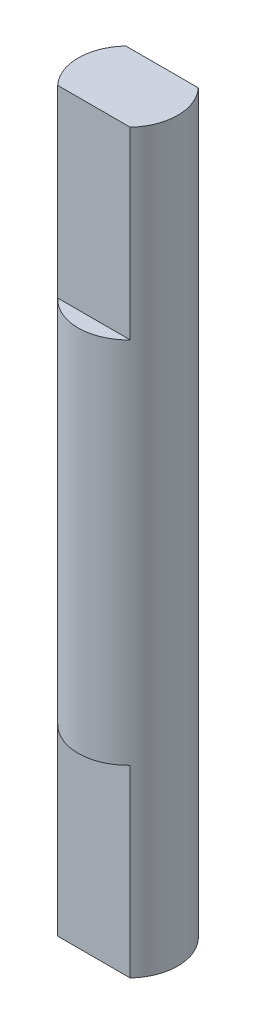
ISO-10303-21;
HEADER;
FILE_DESCRIPTION(('STEP AP214'),'2;1');
FILE_NAME('part.step','',(''),(''),'','','');
FILE_SCHEMA(('AUTOMOTIVE_DESIGN { 1 0 10303 214 1 1 1 1 }'));
ENDSEC;
DATA;
#1=APPLICATION_CONTEXT('core data for automotive mechanical design processes');
#2=APPLICATION_PROTOCOL_DEFINITION('international standard','automotive_design',2000,#1);
#3=PRODUCT_CONTEXT('',#1,'mechanical');
#4=PRODUCT('Part','Part','',(#3));
#5=PRODUCT_RELATED_PRODUCT_CATEGORY('part','',(#4));
#6=PRODUCT_DEFINITION_FORMATION('','',#4);
#7=PRODUCT_DEFINITION_CONTEXT('part definition',#1,'design');
#8=PRODUCT_DEFINITION('design','',#6,#7);
#9=PRODUCT_DEFINITION_SHAPE('','',#8);
#10=(LENGTH_UNIT() NAMED_UNIT(*) SI_UNIT(.MILLI.,.METRE.));
#11=(NAMED_UNIT(*) PLANE_ANGLE_UNIT() SI_UNIT($,.RADIAN.));
#12=(NAMED_UNIT(*) SI_UNIT($,.STERADIAN.) SOLID_ANGLE_UNIT());
#13=UNCERTAINTY_MEASURE_WITH_UNIT(LENGTH_MEASURE(1.E-05),#10,'distance_accuracy_value','');
#14=(GEOMETRIC_REPRESENTATION_CONTEXT(3) GLOBAL_UNCERTAINTY_ASSIGNED_CONTEXT((#13)) GLOBAL_UNIT_ASSIGNED_CONTEXT((#10,
#11,#12)) REPRESENTATION_CONTEXT('',''));
#15=CARTESIAN_POINT('',(0.,0.,0.));
#16=DIRECTION('',(0.,0.,1.));
#17=DIRECTION('',(1.,0.,0.));
#18=AXIS2_PLACEMENT_3D('',#15,#16,#17);
#19=CARTESIAN_POINT('',(0.,-10.,0.));
#20=DIRECTION('',(0.,1.,0.));
#21=DIRECTION('',(0.,0.,1.));
#22=AXIS2_PLACEMENT_3D('',#19,#20,#21);
#23=PLANE('',#22);
#24=CARTESIAN_POINT('',(0.,-10.,0.));
#25=DIRECTION('',(0.,1.,0.));
#26=DIRECTION('',(0.,0.,1.));
#27=AXIS2_PLACEMENT_3D('',#24,#25,#26);
#28=CIRCLE('',#27,2.7);
#29=CARTESIAN_POINT('',(1.96659604392971,-10.,-1.85));
#30=VERTEX_POINT('',#29);
#31=CARTESIAN_POINT('',(-1.96659604392971,-10.,-1.85));
#32=VERTEX_POINT('',#31);
#33=EDGE_CURVE('E154',#30,#32,#28,.T.);
#34=ORIENTED_EDGE('',*,*,#33,.F.);
#35=DIRECTION('',(-1.,0.,0.));
#36=VECTOR('',#35,1.);
#37=CARTESIAN_POINT('',(1.96659604392971,-10.,-1.85));
#38=LINE('',#37,#36);
#39=EDGE_CURVE('E114',#30,#32,#38,.T.);
#40=ORIENTED_EDGE('',*,*,#39,.T.);
#41=EDGE_LOOP('',(#34,#40));
#42=FACE_BOUND('',#41,.T.);
#43=ADVANCED_FACE('F33',(#42),#23,.F.);
#44=CARTESIAN_POINT('',(0.,10.,0.));
#45=DIRECTION('',(0.,1.,0.));
#46=DIRECTION('',(0.,0.,1.));
#47=AXIS2_PLACEMENT_3D('',#44,#45,#46);
#48=PLANE('',#47);
#49=DIRECTION('',(1.,0.,0.));
#50=VECTOR('',#49,1.);
#51=CARTESIAN_POINT('',(1.96659604392971,10.,1.85));
#52=LINE('',#51,#50);
#53=CARTESIAN_POINT('',(-1.96659604392971,10.,1.85));
#54=VERTEX_POINT('',#53);
#55=CARTESIAN_POINT('',(1.96659604392971,10.,1.85));
#56=VERTEX_POINT('',#55);
#57=EDGE_CURVE('E56',#54,#56,#52,.T.);
#58=ORIENTED_EDGE('',*,*,#57,.F.);
#59=CARTESIAN_POINT('',(0.,10.,0.));
#60=DIRECTION('',(0.,1.,0.));
#61=DIRECTION('',(0.,0.,1.));
#62=AXIS2_PLACEMENT_3D('',#59,#60,#61);
#63=CIRCLE('',#62,2.7);
#64=EDGE_CURVE('E42',#54,#56,#63,.T.);
#65=ORIENTED_EDGE('',*,*,#64,.T.);
#66=EDGE_LOOP('',(#58,#65));
#67=FACE_BOUND('',#66,.T.);
#68=ADVANCED_FACE('F171',(#67),#48,.T.);
#69=CARTESIAN_POINT('',(0.,10.,0.));
#70=DIRECTION('',(0.,-1.,0.));
#71=DIRECTION('',(0.,0.,-1.));
#72=AXIS2_PLACEMENT_3D('',#69,#70,#71);
#73=CYLINDRICAL_SURFACE('',#72,2.7);
#74=CARTESIAN_POINT('',(1.96659604392971,10.,-1.85));
#75=VERTEX_POINT('',#74);
#76=CARTESIAN_POINT('',(-1.96659604392971,10.,-1.85));
#77=VERTEX_POINT('',#76);
#78=EDGE_CURVE('E11',#75,#77,#63,.T.);
#79=ORIENTED_EDGE('',*,*,#78,.F.);
#80=DIRECTION('',(0.,-1.,0.));
#81=VECTOR('',#80,1.);
#82=CARTESIAN_POINT('',(1.96659604392971,20.,-1.85));
#83=LINE('',#82,#81);
#84=CARTESIAN_POINT('',(1.96659604392971,20.,-1.85));
#85=VERTEX_POINT('',#84);
#86=EDGE_CURVE('E152',#85,#75,#83,.T.);
#87=ORIENTED_EDGE('',*,*,#86,.F.);
#88=CARTESIAN_POINT('',(0.,20.,0.));
#89=DIRECTION('',(0.,1.,0.));
#90=DIRECTION('',(0.,0.,1.));
#91=AXIS2_PLACEMENT_3D('',#88,#89,#90);
#92=CIRCLE('',#91,2.7);
#93=CARTESIAN_POINT('',(1.96659604392971,20.,1.85));
#94=VERTEX_POINT('',#93);
#95=EDGE_CURVE('E131',#94,#85,#92,.T.);
#96=ORIENTED_EDGE('',*,*,#95,.F.);
#97=DIRECTION('',(0.,-1.,0.));
#98=VECTOR('',#97,1.);
#99=CARTESIAN_POINT('',(1.96659604392971,20.,1.85));
#100=LINE('',#99,#98);
#101=EDGE_CURVE('E140',#94,#56,#100,.T.);
#102=ORIENTED_EDGE('',*,*,#101,.T.);
#103=ORIENTED_EDGE('',*,*,#64,.F.);
#104=DIRECTION('',(0.,-1.,0.));
#105=VECTOR('',#104,1.);
#106=CARTESIAN_POINT('',(-1.96659604392971,20.,1.85));
#107=LINE('',#106,#105);
#108=CARTESIAN_POINT('',(-1.96659604392971,20.,1.85));
#109=VERTEX_POINT('',#108);
#110=EDGE_CURVE('E146',#109,#54,#107,.T.);
#111=ORIENTED_EDGE('',*,*,#110,.F.);
#112=CARTESIAN_POINT('',(0.,20.,0.));
#113=DIRECTION('',(0.,1.,0.));
#114=DIRECTION('',(0.,0.,1.));
#115=AXIS2_PLACEMENT_3D('',#112,#113,#114);
#116=CIRCLE('',#115,2.7);
#117=CARTESIAN_POINT('',(-1.96659604392971,20.,-1.85));
#118=VERTEX_POINT('',#117);
#119=EDGE_CURVE('E136',#118,#109,#116,.T.);
#120=ORIENTED_EDGE('',*,*,#119,.F.);
#121=DIRECTION('',(0.,-1.,0.));
#122=VECTOR('',#121,1.);
#123=CARTESIAN_POINT('',(-1.96659604392971,20.,-1.85));
#124=LINE('',#123,#122);
#125=EDGE_CURVE('E149',#118,#77,#124,.T.);
#126=ORIENTED_EDGE('',*,*,#125,.T.);
#127=EDGE_LOOP('',(#79,#87,#96,#102,#103,#111,#120,#126));
#128=FACE_BOUND('',#127,.T.);
#129=CARTESIAN_POINT('',(-1.96659604392971,-10.,1.85));
#130=VERTEX_POINT('',#129);
#131=CARTESIAN_POINT('',(1.96659604392971,-10.,1.85));
#132=VERTEX_POINT('',#131);
#133=EDGE_CURVE('E37',#130,#132,#28,.T.);
#134=ORIENTED_EDGE('',*,*,#133,.T.);
#135=DIRECTION('',(0.,1.,0.));
#136=VECTOR('',#135,1.);
#137=CARTESIAN_POINT('',(1.96659604392971,-20.,1.85));
#138=LINE('',#137,#136);
#139=CARTESIAN_POINT('',(1.96659604392971,-20.,1.85));
#140=VERTEX_POINT('',#139);
#141=EDGE_CURVE('E49',#140,#132,#138,.T.);
#142=ORIENTED_EDGE('',*,*,#141,.F.);
#143=CARTESIAN_POINT('',(0.,-20.,0.));
#144=DIRECTION('',(0.,1.,0.));
#145=DIRECTION('',(0.,0.,1.));
#146=AXIS2_PLACEMENT_3D('',#143,#144,#145);
#147=CIRCLE('',#146,2.7);
#148=CARTESIAN_POINT('',(1.96659604392971,-20.,-1.85));
#149=VERTEX_POINT('',#148);
#150=EDGE_CURVE('E100',#140,#149,#147,.T.);
#151=ORIENTED_EDGE('',*,*,#150,.T.);
#152=DIRECTION('',(0.,1.,0.));
#153=VECTOR('',#152,1.);
#154=CARTESIAN_POINT('',(1.96659604392971,-20.,-1.85));
#155=LINE('',#154,#153);
#156=EDGE_CURVE('E122',#149,#30,#155,.T.);
#157=ORIENTED_EDGE('',*,*,#156,.T.);
#158=ORIENTED_EDGE('',*,*,#33,.T.);
#159=DIRECTION('',(0.,1.,0.));
#160=VECTOR('',#159,1.);
#161=CARTESIAN_POINT('',(-1.96659604392971,-20.,-1.85));
#162=LINE('',#161,#160);
#163=CARTESIAN_POINT('',(-1.96659604392971,-20.,-1.85));
#164=VERTEX_POINT('',#163);
#165=EDGE_CURVE('E128',#164,#32,#162,.T.);
#166=ORIENTED_EDGE('',*,*,#165,.F.);
#167=CARTESIAN_POINT('',(0.,-20.,0.));
#168=DIRECTION('',(0.,1.,0.));
#169=DIRECTION('',(0.,0.,1.));
#170=AXIS2_PLACEMENT_3D('',#167,#168,#169);
#171=CIRCLE('',#170,2.7);
#172=CARTESIAN_POINT('',(-1.96659604392971,-20.,1.85));
#173=VERTEX_POINT('',#172);
#174=EDGE_CURVE('E117',#164,#173,#171,.T.);
#175=ORIENTED_EDGE('',*,*,#174,.T.);
#176=DIRECTION('',(0.,1.,0.));
#177=VECTOR('',#176,1.);
#178=CARTESIAN_POINT('',(-1.96659604392971,-20.,1.85));
#179=LINE('',#178,#177);
#180=EDGE_CURVE('E104',#173,#130,#179,.T.);
#181=ORIENTED_EDGE('',*,*,#180,.T.);
#182=EDGE_LOOP('',(#134,#142,#151,#157,#158,#166,#175,#181));
#183=FACE_BOUND('',#182,.T.);
#184=ADVANCED_FACE('F35',(#128,#183),#73,.T.);
#185=DIRECTION('',(-1.,0.,0.));
#186=VECTOR('',#185,1.);
#187=CARTESIAN_POINT('',(1.96659604392971,10.,-1.85));
#188=LINE('',#187,#186);
#189=EDGE_CURVE('E103',#75,#77,#188,.T.);
#190=ORIENTED_EDGE('',*,*,#189,.F.);
#191=ORIENTED_EDGE('',*,*,#78,.T.);
#192=EDGE_LOOP('',(#190,#191));
#193=FACE_BOUND('',#192,.T.);
#194=ADVANCED_FACE('F177',(#193),#48,.T.);
#195=ORIENTED_EDGE('',*,*,#133,.F.);
#196=DIRECTION('',(1.,0.,0.));
#197=VECTOR('',#196,1.);
#198=CARTESIAN_POINT('',(1.96659604392971,-10.,1.85));
#199=LINE('',#198,#197);
#200=EDGE_CURVE('E123',#130,#132,#199,.T.);
#201=ORIENTED_EDGE('',*,*,#200,.T.);
#202=EDGE_LOOP('',(#195,#201));
#203=FACE_BOUND('',#202,.T.);
#204=ADVANCED_FACE('F172',(#203),#23,.F.);
#205=CARTESIAN_POINT('',(1.96659604392971,20.,-1.85));
#206=DIRECTION('',(0.,0.,1.));
#207=DIRECTION('',(1.,0.,0.));
#208=AXIS2_PLACEMENT_3D('',#205,#206,#207);
#209=PLANE('',#208);
#210=ORIENTED_EDGE('',*,*,#189,.T.);
#211=ORIENTED_EDGE('',*,*,#125,.F.);
#212=DIRECTION('',(-1.,0.,0.));
#213=VECTOR('',#212,1.);
#214=CARTESIAN_POINT('',(1.96659604392971,20.,-1.85));
#215=LINE('',#214,#213);
#216=EDGE_CURVE('E134',#85,#118,#215,.T.);
#217=ORIENTED_EDGE('',*,*,#216,.F.);
#218=ORIENTED_EDGE('',*,*,#86,.T.);
#219=EDGE_LOOP('',(#210,#211,#217,#218));
#220=FACE_BOUND('',#219,.T.);
#221=ADVANCED_FACE('F179',(#220),#209,.F.);
#222=CARTESIAN_POINT('',(1.96659604392971,20.,1.85));
#223=DIRECTION('',(0.,0.,-1.));
#224=DIRECTION('',(-1.,0.,0.));
#225=AXIS2_PLACEMENT_3D('',#222,#223,#224);
#226=PLANE('',#225);
#227=ORIENTED_EDGE('',*,*,#57,.T.);
#228=ORIENTED_EDGE('',*,*,#101,.F.);
#229=DIRECTION('',(1.,0.,0.));
#230=VECTOR('',#229,1.);
#231=CARTESIAN_POINT('',(1.96659604392971,20.,1.85));
#232=LINE('',#231,#230);
#233=EDGE_CURVE('E138',#109,#94,#232,.T.);
#234=ORIENTED_EDGE('',*,*,#233,.F.);
#235=ORIENTED_EDGE('',*,*,#110,.T.);
#236=EDGE_LOOP('',(#227,#228,#234,#235));
#237=FACE_BOUND('',#236,.T.);
#238=ADVANCED_FACE('F185',(#237),#226,.F.);
#239=CARTESIAN_POINT('',(0.,20.,0.));
#240=DIRECTION('',(0.,1.,0.));
#241=DIRECTION('',(0.,0.,1.));
#242=AXIS2_PLACEMENT_3D('',#239,#240,#241);
#243=PLANE('',#242);
#244=ORIENTED_EDGE('',*,*,#95,.T.);
#245=ORIENTED_EDGE('',*,*,#216,.T.);
#246=ORIENTED_EDGE('',*,*,#119,.T.);
#247=ORIENTED_EDGE('',*,*,#233,.T.);
#248=EDGE_LOOP('',(#244,#245,#246,#247));
#249=FACE_BOUND('',#248,.T.);
#250=ADVANCED_FACE('F168',(#249),#243,.T.);
#251=CARTESIAN_POINT('',(1.96659604392971,-20.,1.85));
#252=DIRECTION('',(0.,0.,1.));
#253=DIRECTION('',(1.,0.,0.));
#254=AXIS2_PLACEMENT_3D('',#251,#252,#253);
#255=PLANE('',#254);
#256=ORIENTED_EDGE('',*,*,#200,.F.);
#257=ORIENTED_EDGE('',*,*,#180,.F.);
#258=DIRECTION('',(1.,0.,0.));
#259=VECTOR('',#258,1.);
#260=CARTESIAN_POINT('',(1.96659604392971,-20.,1.85));
#261=LINE('',#260,#259);
#262=EDGE_CURVE('E110',#173,#140,#261,.T.);
#263=ORIENTED_EDGE('',*,*,#262,.T.);
#264=ORIENTED_EDGE('',*,*,#141,.T.);
#265=EDGE_LOOP('',(#256,#257,#263,#264));
#266=FACE_BOUND('',#265,.T.);
#267=ADVANCED_FACE('F116',(#266),#255,.T.);
#268=CARTESIAN_POINT('',(1.96659604392971,-20.,-1.85));
#269=DIRECTION('',(0.,0.,-1.));
#270=DIRECTION('',(-1.,0.,0.));
#271=AXIS2_PLACEMENT_3D('',#268,#269,#270);
#272=PLANE('',#271);
#273=ORIENTED_EDGE('',*,*,#39,.F.);
#274=ORIENTED_EDGE('',*,*,#156,.F.);
#275=DIRECTION('',(-1.,0.,0.));
#276=VECTOR('',#275,1.);
#277=CARTESIAN_POINT('',(1.96659604392971,-20.,-1.85));
#278=LINE('',#277,#276);
#279=EDGE_CURVE('E113',#149,#164,#278,.T.);
#280=ORIENTED_EDGE('',*,*,#279,.T.);
#281=ORIENTED_EDGE('',*,*,#165,.T.);
#282=EDGE_LOOP('',(#273,#274,#280,#281));
#283=FACE_BOUND('',#282,.T.);
#284=ADVANCED_FACE('F160',(#283),#272,.T.);
#285=CARTESIAN_POINT('',(0.,-20.,0.));
#286=DIRECTION('',(0.,-1.,0.));
#287=DIRECTION('',(0.,0.,1.));
#288=AXIS2_PLACEMENT_3D('',#285,#286,#287);
#289=PLANE('',#288);
#290=ORIENTED_EDGE('',*,*,#150,.F.);
#291=ORIENTED_EDGE('',*,*,#262,.F.);
#292=ORIENTED_EDGE('',*,*,#174,.F.);
#293=ORIENTED_EDGE('',*,*,#279,.F.);
#294=EDGE_LOOP('',(#290,#291,#292,#293));
#295=FACE_BOUND('',#294,.T.);
#296=ADVANCED_FACE('F108',(#295),#289,.T.);
#297=CLOSED_SHELL('',(#43,#68,#184,#194,#204,#221,#238,#250,#267,#284,#296));
#298=MANIFOLD_SOLID_BREP('B2',#297);
#299=ADVANCED_BREP_SHAPE_REPRESENTATION('',(#18,#298),#14);
#300=SHAPE_DEFINITION_REPRESENTATION(#9,#299);
ENDSEC;
END-ISO-10303-21;
